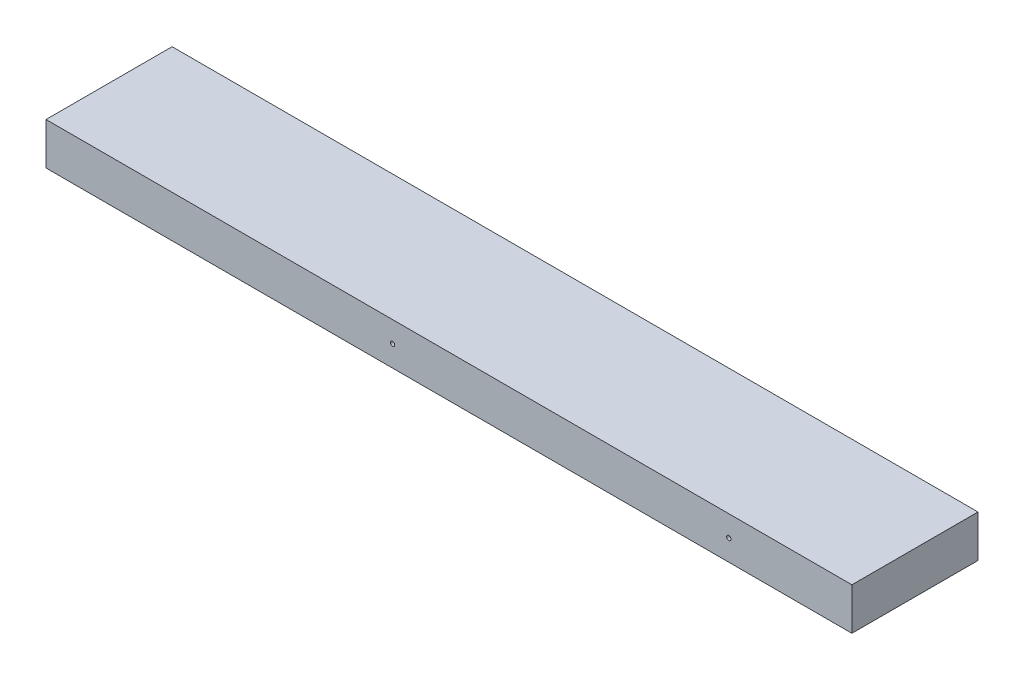
ISO-10303-21;
HEADER;
FILE_DESCRIPTION(('STEP AP214'),'2;1');
FILE_NAME('part.step','',(''),(''),'','','');
FILE_SCHEMA(('AUTOMOTIVE_DESIGN { 1 0 10303 214 1 1 1 1 }'));
ENDSEC;
DATA;
#1=APPLICATION_CONTEXT('core data for automotive mechanical design processes');
#2=APPLICATION_PROTOCOL_DEFINITION('international standard','automotive_design',2000,#1);
#3=PRODUCT_CONTEXT('',#1,'mechanical');
#4=PRODUCT('Part','Part','',(#3));
#5=PRODUCT_RELATED_PRODUCT_CATEGORY('part','',(#4));
#6=PRODUCT_DEFINITION_FORMATION('','',#4);
#7=PRODUCT_DEFINITION_CONTEXT('part definition',#1,'design');
#8=PRODUCT_DEFINITION('design','',#6,#7);
#9=PRODUCT_DEFINITION_SHAPE('','',#8);
#10=(LENGTH_UNIT() NAMED_UNIT(*) SI_UNIT(.MILLI.,.METRE.));
#11=(NAMED_UNIT(*) PLANE_ANGLE_UNIT() SI_UNIT($,.RADIAN.));
#12=(NAMED_UNIT(*) SI_UNIT($,.STERADIAN.) SOLID_ANGLE_UNIT());
#13=UNCERTAINTY_MEASURE_WITH_UNIT(LENGTH_MEASURE(1.E-05),#10,'distance_accuracy_value','');
#14=(GEOMETRIC_REPRESENTATION_CONTEXT(3) GLOBAL_UNCERTAINTY_ASSIGNED_CONTEXT((#13)) GLOBAL_UNIT_ASSIGNED_CONTEXT((#10,
#11,#12)) REPRESENTATION_CONTEXT('',''));
#15=CARTESIAN_POINT('',(0.,0.,0.));
#16=DIRECTION('',(0.,0.,1.));
#17=DIRECTION('',(1.,0.,0.));
#18=AXIS2_PLACEMENT_3D('',#15,#16,#17);
#19=CARTESIAN_POINT('',(-86.3599999999995,5213.35,2683.51));
#20=DIRECTION('',(0.,-1.,0.));
#21=DIRECTION('',(0.,0.,-1.));
#22=AXIS2_PLACEMENT_3D('',#19,#20,#21);
#23=PLANE('',#22);
#24=DIRECTION('',(-1.,0.,0.));
#25=VECTOR('',#24,1.);
#26=CARTESIAN_POINT('',(-265.815570864871,5213.35,2683.51));
#27=LINE('',#26,#25);
#28=CARTESIAN_POINT('',(-80.0099999999995,5213.35,2683.51));
#29=VERTEX_POINT('',#28);
#30=CARTESIAN_POINT('',(-445.271141729743,5213.35,2683.51));
#31=VERTEX_POINT('',#30);
#32=EDGE_CURVE('E142',#29,#31,#27,.T.);
#33=ORIENTED_EDGE('',*,*,#32,.F.);
#34=DIRECTION('',(0.,0.,1.));
#35=VECTOR('',#34,1.);
#36=CARTESIAN_POINT('',(-80.0099999999995,5213.35,2683.51));
#37=LINE('',#36,#35);
#38=CARTESIAN_POINT('',(-80.0099999999995,5213.35,2740.66));
#39=VERTEX_POINT('',#38);
#40=EDGE_CURVE('E133',#29,#39,#37,.T.);
#41=ORIENTED_EDGE('',*,*,#40,.T.);
#42=DIRECTION('',(1.,0.,0.));
#43=VECTOR('',#42,1.);
#44=CARTESIAN_POINT('',(-265.815570864871,5213.35,2740.66));
#45=LINE('',#44,#43);
#46=CARTESIAN_POINT('',(-445.271141729743,5213.35,2740.66));
#47=VERTEX_POINT('',#46);
#48=EDGE_CURVE('E136',#47,#39,#45,.T.);
#49=ORIENTED_EDGE('',*,*,#48,.F.);
#50=DIRECTION('',(0.,0.,-1.));
#51=VECTOR('',#50,1.);
#52=CARTESIAN_POINT('',(-445.271141729743,5213.35,2683.51));
#53=LINE('',#52,#51);
#54=EDGE_CURVE('E145',#47,#31,#53,.T.);
#55=ORIENTED_EDGE('',*,*,#54,.T.);
#56=EDGE_LOOP('',(#33,#41,#49,#55));
#57=FACE_BOUND('',#56,.T.);
#58=ADVANCED_FACE('F37',(#57),#23,.T.);
#59=CARTESIAN_POINT('',(-265.815570864871,5222.875,2740.66));
#60=DIRECTION('',(0.,0.,-1.));
#61=DIRECTION('',(1.,0.,0.));
#62=AXIS2_PLACEMENT_3D('',#59,#60,#61);
#63=PLANE('',#62);
#64=CARTESIAN_POINT('',(-135.802759022741,5222.875,2740.66));
#65=DIRECTION('',(0.,0.,1.));
#66=DIRECTION('',(1.,0.,0.));
#67=AXIS2_PLACEMENT_3D('',#64,#65,#66);
#68=CIRCLE('',#67,0.991870000000006);
#69=CARTESIAN_POINT('',(-134.810889022741,5222.875,2740.66));
#70=VERTEX_POINT('',#69);
#71=EDGE_CURVE('E40',#70,#70,#68,.T.);
#72=ORIENTED_EDGE('',*,*,#71,.F.);
#73=EDGE_LOOP('',(#72));
#74=FACE_BOUND('',#73,.T.);
#75=CARTESIAN_POINT('',(-288.202759022741,5222.875,2740.66));
#76=DIRECTION('',(0.,0.,1.));
#77=DIRECTION('',(1.,0.,0.));
#78=AXIS2_PLACEMENT_3D('',#75,#76,#77);
#79=CIRCLE('',#78,0.991870000000006);
#80=CARTESIAN_POINT('',(-287.210889022741,5222.875,2740.66));
#81=VERTEX_POINT('',#80);
#82=EDGE_CURVE('E117',#81,#81,#79,.T.);
#83=ORIENTED_EDGE('',*,*,#82,.F.);
#84=EDGE_LOOP('',(#83));
#85=FACE_BOUND('',#84,.T.);
#86=DIRECTION('',(-1.,0.,0.));
#87=VECTOR('',#86,1.);
#88=CARTESIAN_POINT('',(-445.271141729743,5232.4,2740.66));
#89=LINE('',#88,#87);
#90=CARTESIAN_POINT('',(-80.0099999999995,5232.4,2740.66));
#91=VERTEX_POINT('',#90);
#92=CARTESIAN_POINT('',(-445.271141729743,5232.4,2740.66));
#93=VERTEX_POINT('',#92);
#94=EDGE_CURVE('E139',#91,#93,#89,.T.);
#95=ORIENTED_EDGE('',*,*,#94,.T.);
#96=DIRECTION('',(0.,1.,0.));
#97=VECTOR('',#96,1.);
#98=CARTESIAN_POINT('',(-445.271141729743,5213.35,2740.66));
#99=LINE('',#98,#97);
#100=EDGE_CURVE('E71',#93,#47,#99,.F.);
#101=ORIENTED_EDGE('',*,*,#100,.T.);
#102=ORIENTED_EDGE('',*,*,#48,.T.);
#103=DIRECTION('',(0.,1.,0.));
#104=VECTOR('',#103,1.);
#105=CARTESIAN_POINT('',(-80.0099999999995,5213.35,2740.66));
#106=LINE('',#105,#104);
#107=EDGE_CURVE('E81',#39,#91,#106,.T.);
#108=ORIENTED_EDGE('',*,*,#107,.T.);
#109=EDGE_LOOP('',(#95,#101,#102,#108));
#110=FACE_BOUND('',#109,.T.);
#111=ADVANCED_FACE('F159',(#74,#85,#110),#63,.F.);
#112=CARTESIAN_POINT('',(-445.271141729743,5213.35,2683.51));
#113=DIRECTION('',(-1.,0.,0.));
#114=DIRECTION('',(0.,0.,-1.));
#115=AXIS2_PLACEMENT_3D('',#112,#113,#114);
#116=PLANE('',#115);
#117=DIRECTION('',(0.,1.,0.));
#118=VECTOR('',#117,1.);
#119=CARTESIAN_POINT('',(-445.271141729743,5222.875,2683.51));
#120=LINE('',#119,#118);
#121=CARTESIAN_POINT('',(-445.271141729743,5232.4,2683.51));
#122=VERTEX_POINT('',#121);
#123=EDGE_CURVE('E64',#31,#122,#120,.T.);
#124=ORIENTED_EDGE('',*,*,#123,.F.);
#125=ORIENTED_EDGE('',*,*,#54,.F.);
#126=ORIENTED_EDGE('',*,*,#100,.F.);
#127=DIRECTION('',(0.,0.,1.));
#128=VECTOR('',#127,1.);
#129=CARTESIAN_POINT('',(-445.271141729743,5232.4,2683.51));
#130=LINE('',#129,#128);
#131=EDGE_CURVE('E46',#93,#122,#130,.F.);
#132=ORIENTED_EDGE('',*,*,#131,.T.);
#133=EDGE_LOOP('',(#124,#125,#126,#132));
#134=FACE_BOUND('',#133,.T.);
#135=ADVANCED_FACE('F161',(#134),#116,.T.);
#136=CARTESIAN_POINT('',(-265.815570864871,5222.875,2683.51));
#137=DIRECTION('',(0.,0.,1.));
#138=DIRECTION('',(-1.,0.,0.));
#139=AXIS2_PLACEMENT_3D('',#136,#137,#138);
#140=PLANE('',#139);
#141=CARTESIAN_POINT('',(-415.202759022741,5222.875,2683.51));
#142=DIRECTION('',(0.,0.,-1.));
#143=DIRECTION('',(-1.,0.,0.));
#144=AXIS2_PLACEMENT_3D('',#141,#142,#143);
#145=CIRCLE('',#144,0.991870000000006);
#146=CARTESIAN_POINT('',(-416.194629022741,5222.875,2683.51));
#147=VERTEX_POINT('',#146);
#148=EDGE_CURVE('E121',#147,#147,#145,.T.);
#149=ORIENTED_EDGE('',*,*,#148,.F.);
#150=EDGE_LOOP('',(#149));
#151=FACE_BOUND('',#150,.T.);
#152=CARTESIAN_POINT('',(-313.602759022741,5222.875,2683.51));
#153=DIRECTION('',(0.,0.,-1.));
#154=DIRECTION('',(-1.,0.,0.));
#155=AXIS2_PLACEMENT_3D('',#152,#153,#154);
#156=CIRCLE('',#155,0.991870000000006);
#157=CARTESIAN_POINT('',(-314.594629022741,5222.875,2683.51));
#158=VERTEX_POINT('',#157);
#159=EDGE_CURVE('E125',#158,#158,#156,.T.);
#160=ORIENTED_EDGE('',*,*,#159,.F.);
#161=EDGE_LOOP('',(#160));
#162=FACE_BOUND('',#161,.T.);
#163=CARTESIAN_POINT('',(-110.402759022741,5222.875,2683.51));
#164=DIRECTION('',(0.,0.,-1.));
#165=DIRECTION('',(-1.,0.,0.));
#166=AXIS2_PLACEMENT_3D('',#163,#164,#165);
#167=CIRCLE('',#166,0.991870000000006);
#168=CARTESIAN_POINT('',(-111.394629022741,5222.875,2683.51));
#169=VERTEX_POINT('',#168);
#170=EDGE_CURVE('E129',#169,#169,#167,.T.);
#171=ORIENTED_EDGE('',*,*,#170,.F.);
#172=EDGE_LOOP('',(#171));
#173=FACE_BOUND('',#172,.T.);
#174=ORIENTED_EDGE('',*,*,#123,.T.);
#175=DIRECTION('',(-1.,0.,0.));
#176=VECTOR('',#175,1.);
#177=CARTESIAN_POINT('',(-445.271141729743,5232.4,2683.51));
#178=LINE('',#177,#176);
#179=CARTESIAN_POINT('',(-80.0099999999995,5232.4,2683.51));
#180=VERTEX_POINT('',#179);
#181=EDGE_CURVE('E11',#122,#180,#178,.F.);
#182=ORIENTED_EDGE('',*,*,#181,.T.);
#183=DIRECTION('',(0.,-1.,0.));
#184=VECTOR('',#183,1.);
#185=CARTESIAN_POINT('',(-80.0099999999995,5232.4,2683.51));
#186=LINE('',#185,#184);
#187=EDGE_CURVE('E131',#180,#29,#186,.T.);
#188=ORIENTED_EDGE('',*,*,#187,.T.);
#189=ORIENTED_EDGE('',*,*,#32,.T.);
#190=EDGE_LOOP('',(#174,#182,#188,#189));
#191=FACE_BOUND('',#190,.T.);
#192=ADVANCED_FACE('F170',(#151,#162,#173,#191),#140,.F.);
#193=CARTESIAN_POINT('',(-445.271141729743,5232.4,2683.51));
#194=DIRECTION('',(0.,1.,0.));
#195=DIRECTION('',(0.,0.,1.));
#196=AXIS2_PLACEMENT_3D('',#193,#194,#195);
#197=PLANE('',#196);
#198=ORIENTED_EDGE('',*,*,#181,.F.);
#199=ORIENTED_EDGE('',*,*,#131,.F.);
#200=ORIENTED_EDGE('',*,*,#94,.F.);
#201=DIRECTION('',(0.,0.,-1.));
#202=VECTOR('',#201,1.);
#203=CARTESIAN_POINT('',(-80.0099999999995,5232.4,2740.66));
#204=LINE('',#203,#202);
#205=EDGE_CURVE('E77',#91,#180,#204,.T.);
#206=ORIENTED_EDGE('',*,*,#205,.T.);
#207=EDGE_LOOP('',(#198,#199,#200,#206));
#208=FACE_BOUND('',#207,.T.);
#209=ADVANCED_FACE('F164',(#208),#197,.T.);
#210=CARTESIAN_POINT('',(-80.0099999999995,0.,0.));
#211=DIRECTION('',(1.,0.,0.));
#212=DIRECTION('',(0.,0.,1.));
#213=AXIS2_PLACEMENT_3D('',#210,#211,#212);
#214=PLANE('',#213);
#215=ORIENTED_EDGE('',*,*,#205,.F.);
#216=ORIENTED_EDGE('',*,*,#107,.F.);
#217=ORIENTED_EDGE('',*,*,#40,.F.);
#218=ORIENTED_EDGE('',*,*,#187,.F.);
#219=EDGE_LOOP('',(#215,#216,#217,#218));
#220=FACE_BOUND('',#219,.T.);
#221=ADVANCED_FACE('F168',(#220),#214,.T.);
#222=CARTESIAN_POINT('',(-110.402759022741,5222.875,2664.46));
#223=DIRECTION('',(0.,0.,-1.));
#224=DIRECTION('',(1.,0.,0.));
#225=AXIS2_PLACEMENT_3D('',#222,#223,#224);
#226=CYLINDRICAL_SURFACE('',#225,0.991870000000006);
#227=CARTESIAN_POINT('',(-110.402759022741,5222.875,2702.56));
#228=DIRECTION('',(0.,0.,1.));
#229=DIRECTION('',(1.,0.,0.));
#230=AXIS2_PLACEMENT_3D('',#227,#228,#229);
#231=CIRCLE('',#230,0.991870000000006);
#232=CARTESIAN_POINT('',(-109.410889022741,5222.875,2702.56));
#233=VERTEX_POINT('',#232);
#234=EDGE_CURVE('E126',#233,#233,#231,.T.);
#235=ORIENTED_EDGE('',*,*,#234,.T.);
#236=EDGE_LOOP('',(#235));
#237=FACE_BOUND('',#236,.T.);
#238=ORIENTED_EDGE('',*,*,#170,.T.);
#239=EDGE_LOOP('',(#238));
#240=FACE_BOUND('',#239,.T.);
#241=ADVANCED_FACE('F214',(#237,#240),#226,.F.);
#242=CARTESIAN_POINT('',(-110.402759022741,5222.875,2702.56));
#243=DIRECTION('',(0.,0.,-1.));
#244=DIRECTION('',(1.,0.,0.));
#245=AXIS2_PLACEMENT_3D('',#242,#243,#244);
#246=CONICAL_SURFACE('',#245,0.991870000000006,1.02974425867677);
#247=CARTESIAN_POINT('',(-110.402759022741,5222.875,2703.1559756222));
#248=VERTEX_POINT('',#247);
#249=VERTEX_LOOP('',#248);
#250=FACE_BOUND('',#249,.T.);
#251=ORIENTED_EDGE('',*,*,#234,.F.);
#252=EDGE_LOOP('',(#251));
#253=FACE_BOUND('',#252,.T.);
#254=ADVANCED_FACE('F223',(#250,#253),#246,.F.);
#255=CARTESIAN_POINT('',(-313.602759022741,5222.875,2664.46));
#256=DIRECTION('',(0.,0.,-1.));
#257=DIRECTION('',(1.,0.,0.));
#258=AXIS2_PLACEMENT_3D('',#255,#256,#257);
#259=CYLINDRICAL_SURFACE('',#258,0.991870000000006);
#260=CARTESIAN_POINT('',(-313.602759022741,5222.875,2702.56));
#261=DIRECTION('',(0.,0.,1.));
#262=DIRECTION('',(1.,0.,0.));
#263=AXIS2_PLACEMENT_3D('',#260,#261,#262);
#264=CIRCLE('',#263,0.991870000000006);
#265=CARTESIAN_POINT('',(-312.610889022741,5222.875,2702.56));
#266=VERTEX_POINT('',#265);
#267=EDGE_CURVE('E122',#266,#266,#264,.T.);
#268=ORIENTED_EDGE('',*,*,#267,.T.);
#269=EDGE_LOOP('',(#268));
#270=FACE_BOUND('',#269,.T.);
#271=ORIENTED_EDGE('',*,*,#159,.T.);
#272=EDGE_LOOP('',(#271));
#273=FACE_BOUND('',#272,.T.);
#274=ADVANCED_FACE('F233',(#270,#273),#259,.F.);
#275=CARTESIAN_POINT('',(-313.602759022741,5222.875,2702.56));
#276=DIRECTION('',(0.,0.,-1.));
#277=DIRECTION('',(1.,0.,0.));
#278=AXIS2_PLACEMENT_3D('',#275,#276,#277);
#279=CONICAL_SURFACE('',#278,0.991870000000006,1.02974425867677);
#280=CARTESIAN_POINT('',(-313.602759022741,5222.875,2703.1559756222));
#281=VERTEX_POINT('',#280);
#282=VERTEX_LOOP('',#281);
#283=FACE_BOUND('',#282,.T.);
#284=ORIENTED_EDGE('',*,*,#267,.F.);
#285=EDGE_LOOP('',(#284));
#286=FACE_BOUND('',#285,.T.);
#287=ADVANCED_FACE('F243',(#283,#286),#279,.F.);
#288=CARTESIAN_POINT('',(-415.202759022741,5222.875,2664.46));
#289=DIRECTION('',(0.,0.,-1.));
#290=DIRECTION('',(1.,0.,0.));
#291=AXIS2_PLACEMENT_3D('',#288,#289,#290);
#292=CYLINDRICAL_SURFACE('',#291,0.991870000000006);
#293=CARTESIAN_POINT('',(-415.202759022741,5222.875,2702.56));
#294=DIRECTION('',(0.,0.,1.));
#295=DIRECTION('',(1.,0.,0.));
#296=AXIS2_PLACEMENT_3D('',#293,#294,#295);
#297=CIRCLE('',#296,0.991870000000006);
#298=CARTESIAN_POINT('',(-414.210889022741,5222.875,2702.56));
#299=VERTEX_POINT('',#298);
#300=EDGE_CURVE('E118',#299,#299,#297,.T.);
#301=ORIENTED_EDGE('',*,*,#300,.T.);
#302=EDGE_LOOP('',(#301));
#303=FACE_BOUND('',#302,.T.);
#304=ORIENTED_EDGE('',*,*,#148,.T.);
#305=EDGE_LOOP('',(#304));
#306=FACE_BOUND('',#305,.T.);
#307=ADVANCED_FACE('F253',(#303,#306),#292,.F.);
#308=CARTESIAN_POINT('',(-415.202759022741,5222.875,2702.56));
#309=DIRECTION('',(0.,0.,-1.));
#310=DIRECTION('',(1.,0.,0.));
#311=AXIS2_PLACEMENT_3D('',#308,#309,#310);
#312=CONICAL_SURFACE('',#311,0.991870000000006,1.02974425867677);
#313=CARTESIAN_POINT('',(-415.202759022741,5222.875,2703.1559756222));
#314=VERTEX_POINT('',#313);
#315=VERTEX_LOOP('',#314);
#316=FACE_BOUND('',#315,.T.);
#317=ORIENTED_EDGE('',*,*,#300,.F.);
#318=EDGE_LOOP('',(#317));
#319=FACE_BOUND('',#318,.T.);
#320=ADVANCED_FACE('F263',(#316,#319),#312,.F.);
#321=CARTESIAN_POINT('',(-288.202759022741,5222.875,2759.71000000001));
#322=DIRECTION('',(0.,0.,1.));
#323=DIRECTION('',(-1.,0.,0.));
#324=AXIS2_PLACEMENT_3D('',#321,#322,#323);
#325=CYLINDRICAL_SURFACE('',#324,0.991870000000006);
#326=CARTESIAN_POINT('',(-288.202759022741,5222.875,2721.61000000001));
#327=DIRECTION('',(0.,0.,-1.));
#328=DIRECTION('',(-1.,0.,0.));
#329=AXIS2_PLACEMENT_3D('',#326,#327,#328);
#330=CIRCLE('',#329,0.991870000000006);
#331=CARTESIAN_POINT('',(-289.194629022741,5222.875,2721.61000000001));
#332=VERTEX_POINT('',#331);
#333=EDGE_CURVE('E113',#332,#332,#330,.T.);
#334=ORIENTED_EDGE('',*,*,#333,.T.);
#335=EDGE_LOOP('',(#334));
#336=FACE_BOUND('',#335,.T.);
#337=ORIENTED_EDGE('',*,*,#82,.T.);
#338=EDGE_LOOP('',(#337));
#339=FACE_BOUND('',#338,.T.);
#340=ADVANCED_FACE('F157',(#336,#339),#325,.F.);
#341=CARTESIAN_POINT('',(-288.202759022741,5222.875,2721.61000000001));
#342=DIRECTION('',(0.,0.,1.));
#343=DIRECTION('',(-1.,0.,0.));
#344=AXIS2_PLACEMENT_3D('',#341,#342,#343);
#345=CONICAL_SURFACE('',#344,0.991870000000006,1.02974425867677);
#346=CARTESIAN_POINT('',(-288.202759022741,5222.875,2721.01402437781));
#347=VERTEX_POINT('',#346);
#348=VERTEX_LOOP('',#347);
#349=FACE_BOUND('',#348,.T.);
#350=ORIENTED_EDGE('',*,*,#333,.F.);
#351=EDGE_LOOP('',(#350));
#352=FACE_BOUND('',#351,.T.);
#353=ADVANCED_FACE('F282',(#349,#352),#345,.F.);
#354=CARTESIAN_POINT('',(-135.802759022741,5222.875,2759.71000000001));
#355=DIRECTION('',(0.,0.,1.));
#356=DIRECTION('',(-1.,0.,0.));
#357=AXIS2_PLACEMENT_3D('',#354,#355,#356);
#358=CYLINDRICAL_SURFACE('',#357,0.991870000000006);
#359=CARTESIAN_POINT('',(-135.802759022741,5222.875,2721.61000000001));
#360=DIRECTION('',(0.,0.,-1.));
#361=DIRECTION('',(-1.,0.,0.));
#362=AXIS2_PLACEMENT_3D('',#359,#360,#361);
#363=CIRCLE('',#362,0.991870000000006);
#364=CARTESIAN_POINT('',(-136.794629022741,5222.875,2721.61000000001));
#365=VERTEX_POINT('',#364);
#366=EDGE_CURVE('E109',#365,#365,#363,.T.);
#367=ORIENTED_EDGE('',*,*,#366,.T.);
#368=EDGE_LOOP('',(#367));
#369=FACE_BOUND('',#368,.T.);
#370=ORIENTED_EDGE('',*,*,#71,.T.);
#371=EDGE_LOOP('',(#370));
#372=FACE_BOUND('',#371,.T.);
#373=ADVANCED_FACE('F105',(#369,#372),#358,.F.);
#374=CARTESIAN_POINT('',(-135.802759022741,5222.875,2721.61000000001));
#375=DIRECTION('',(0.,0.,1.));
#376=DIRECTION('',(-1.,0.,0.));
#377=AXIS2_PLACEMENT_3D('',#374,#375,#376);
#378=CONICAL_SURFACE('',#377,0.991870000000006,1.02974425867677);
#379=CARTESIAN_POINT('',(-135.802759022741,5222.875,2721.01402437781));
#380=VERTEX_POINT('',#379);
#381=VERTEX_LOOP('',#380);
#382=FACE_BOUND('',#381,.T.);
#383=ORIENTED_EDGE('',*,*,#366,.F.);
#384=EDGE_LOOP('',(#383));
#385=FACE_BOUND('',#384,.T.);
#386=ADVANCED_FACE('F102',(#382,#385),#378,.F.);
#387=CLOSED_SHELL('',(#58,#111,#135,#192,#209,#221,#241,#254,#274,#287,#307,#320,#340,#353,#373,#386));
#388=MANIFOLD_SOLID_BREP('B2',#387);
#389=ADVANCED_BREP_SHAPE_REPRESENTATION('',(#18,#388),#14);
#390=SHAPE_DEFINITION_REPRESENTATION(#9,#389);
ENDSEC;
END-ISO-10303-21;
